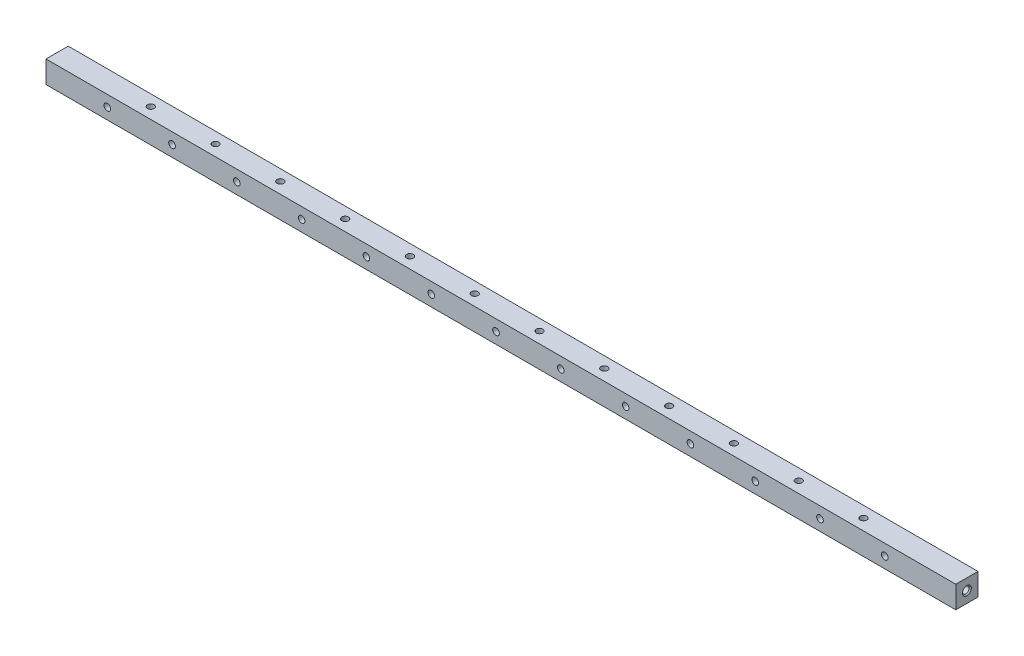
ISO-10303-21;
HEADER;
FILE_DESCRIPTION(('STEP AP214'),'2;1');
FILE_NAME('part.step','',(''),(''),'','','');
FILE_SCHEMA(('AUTOMOTIVE_DESIGN { 1 0 10303 214 1 1 1 1 }'));
ENDSEC;
DATA;
#1=APPLICATION_CONTEXT('core data for automotive mechanical design processes');
#2=APPLICATION_PROTOCOL_DEFINITION('international standard','automotive_design',2000,#1);
#3=PRODUCT_CONTEXT('',#1,'mechanical');
#4=PRODUCT('Part','Part','',(#3));
#5=PRODUCT_RELATED_PRODUCT_CATEGORY('part','',(#4));
#6=PRODUCT_DEFINITION_FORMATION('','',#4);
#7=PRODUCT_DEFINITION_CONTEXT('part definition',#1,'design');
#8=PRODUCT_DEFINITION('design','',#6,#7);
#9=PRODUCT_DEFINITION_SHAPE('','',#8);
#10=(LENGTH_UNIT() NAMED_UNIT(*) SI_UNIT(.MILLI.,.METRE.));
#11=(NAMED_UNIT(*) PLANE_ANGLE_UNIT() SI_UNIT($,.RADIAN.));
#12=(NAMED_UNIT(*) SI_UNIT($,.STERADIAN.) SOLID_ANGLE_UNIT());
#13=UNCERTAINTY_MEASURE_WITH_UNIT(LENGTH_MEASURE(1.E-05),#10,'distance_accuracy_value','');
#14=(GEOMETRIC_REPRESENTATION_CONTEXT(3) GLOBAL_UNCERTAINTY_ASSIGNED_CONTEXT((#13)) GLOBAL_UNIT_ASSIGNED_CONTEXT((#10,
#11,#12)) REPRESENTATION_CONTEXT('',''));
#15=CARTESIAN_POINT('',(0.,0.,0.));
#16=DIRECTION('',(0.,0.,1.));
#17=DIRECTION('',(1.,0.,0.));
#18=AXIS2_PLACEMENT_3D('',#15,#16,#17);
#19=CARTESIAN_POINT('',(520.7,6.35,-6.35));
#20=DIRECTION('',(0.,-1.,0.));
#21=DIRECTION('',(0.,0.,-1.));
#22=AXIS2_PLACEMENT_3D('',#19,#20,#21);
#23=PLANE('',#22);
#24=CARTESIAN_POINT('',(461.518,6.35,0.));
#25=DIRECTION('',(0.,1.,0.));
#26=DIRECTION('',(0.,0.,1.));
#27=AXIS2_PLACEMENT_3D('',#24,#25,#26);
#28=CIRCLE('',#27,1.89865);
#29=CARTESIAN_POINT('',(461.518,6.35,1.89865));
#30=VERTEX_POINT('',#29);
#31=EDGE_CURVE('E783',#30,#30,#28,.T.);
#32=ORIENTED_EDGE('',*,*,#31,.F.);
#33=EDGE_LOOP('',(#32));
#34=FACE_BOUND('',#33,.T.);
#35=CARTESIAN_POINT('',(387.35,6.35,0.));
#36=DIRECTION('',(0.,1.,0.));
#37=DIRECTION('',(0.,0.,1.));
#38=AXIS2_PLACEMENT_3D('',#35,#36,#37);
#39=CIRCLE('',#38,1.89865);
#40=CARTESIAN_POINT('',(387.35,6.35,1.89865));
#41=VERTEX_POINT('',#40);
#42=EDGE_CURVE('E780',#41,#41,#39,.T.);
#43=ORIENTED_EDGE('',*,*,#42,.F.);
#44=EDGE_LOOP('',(#43));
#45=FACE_BOUND('',#44,.T.);
#46=CARTESIAN_POINT('',(350.266,6.35,0.));
#47=DIRECTION('',(0.,1.,0.));
#48=DIRECTION('',(0.,0.,1.));
#49=AXIS2_PLACEMENT_3D('',#46,#47,#48);
#50=CIRCLE('',#49,1.89865);
#51=CARTESIAN_POINT('',(350.266,6.35,1.89865));
#52=VERTEX_POINT('',#51);
#53=EDGE_CURVE('E794',#52,#52,#50,.T.);
#54=ORIENTED_EDGE('',*,*,#53,.F.);
#55=EDGE_LOOP('',(#54));
#56=FACE_BOUND('',#55,.T.);
#57=CARTESIAN_POINT('',(313.182,6.35,0.));
#58=DIRECTION('',(0.,1.,0.));
#59=DIRECTION('',(0.,0.,1.));
#60=AXIS2_PLACEMENT_3D('',#57,#58,#59);
#61=CIRCLE('',#60,1.89865);
#62=CARTESIAN_POINT('',(313.182,6.35,1.89865));
#63=VERTEX_POINT('',#62);
#64=EDGE_CURVE('E802',#63,#63,#61,.T.);
#65=ORIENTED_EDGE('',*,*,#64,.F.);
#66=EDGE_LOOP('',(#65));
#67=FACE_BOUND('',#66,.T.);
#68=CARTESIAN_POINT('',(239.014,6.35,0.));
#69=DIRECTION('',(0.,1.,0.));
#70=DIRECTION('',(0.,0.,1.));
#71=AXIS2_PLACEMENT_3D('',#68,#69,#70);
#72=CIRCLE('',#71,1.89865);
#73=CARTESIAN_POINT('',(239.014,6.35,1.89865));
#74=VERTEX_POINT('',#73);
#75=EDGE_CURVE('E816',#74,#74,#72,.T.);
#76=ORIENTED_EDGE('',*,*,#75,.F.);
#77=EDGE_LOOP('',(#76));
#78=FACE_BOUND('',#77,.T.);
#79=CARTESIAN_POINT('',(201.93,6.35,0.));
#80=DIRECTION('',(0.,1.,0.));
#81=DIRECTION('',(0.,0.,1.));
#82=AXIS2_PLACEMENT_3D('',#79,#80,#81);
#83=CIRCLE('',#82,1.89865);
#84=CARTESIAN_POINT('',(201.93,6.35,1.89865));
#85=VERTEX_POINT('',#84);
#86=EDGE_CURVE('E822',#85,#85,#83,.T.);
#87=ORIENTED_EDGE('',*,*,#86,.F.);
#88=EDGE_LOOP('',(#87));
#89=FACE_BOUND('',#88,.T.);
#90=CARTESIAN_POINT('',(164.846,6.35,0.));
#91=DIRECTION('',(0.,1.,0.));
#92=DIRECTION('',(0.,0.,1.));
#93=AXIS2_PLACEMENT_3D('',#90,#91,#92);
#94=CIRCLE('',#93,1.89865);
#95=CARTESIAN_POINT('',(164.846,6.35,1.89865));
#96=VERTEX_POINT('',#95);
#97=EDGE_CURVE('E830',#96,#96,#94,.T.);
#98=ORIENTED_EDGE('',*,*,#97,.F.);
#99=EDGE_LOOP('',(#98));
#100=FACE_BOUND('',#99,.T.);
#101=CARTESIAN_POINT('',(127.762,6.35,0.));
#102=DIRECTION('',(0.,1.,0.));
#103=DIRECTION('',(0.,0.,1.));
#104=AXIS2_PLACEMENT_3D('',#101,#102,#103);
#105=CIRCLE('',#104,1.89865);
#106=CARTESIAN_POINT('',(127.762,6.35,1.89865));
#107=VERTEX_POINT('',#106);
#108=EDGE_CURVE('E838',#107,#107,#105,.T.);
#109=ORIENTED_EDGE('',*,*,#108,.F.);
#110=EDGE_LOOP('',(#109));
#111=FACE_BOUND('',#110,.T.);
#112=CARTESIAN_POINT('',(90.678,6.35,0.));
#113=DIRECTION('',(0.,1.,0.));
#114=DIRECTION('',(0.,0.,1.));
#115=AXIS2_PLACEMENT_3D('',#112,#113,#114);
#116=CIRCLE('',#115,1.89864999999999);
#117=CARTESIAN_POINT('',(90.678,6.35,1.89864999999999));
#118=VERTEX_POINT('',#117);
#119=EDGE_CURVE('E846',#118,#118,#116,.T.);
#120=ORIENTED_EDGE('',*,*,#119,.F.);
#121=EDGE_LOOP('',(#120));
#122=FACE_BOUND('',#121,.T.);
#123=CARTESIAN_POINT('',(53.594,6.35,0.));
#124=DIRECTION('',(0.,1.,0.));
#125=DIRECTION('',(0.,0.,1.));
#126=AXIS2_PLACEMENT_3D('',#123,#124,#125);
#127=CIRCLE('',#126,1.89864999999999);
#128=CARTESIAN_POINT('',(53.594,6.35,1.89864999999999));
#129=VERTEX_POINT('',#128);
#130=EDGE_CURVE('E137',#129,#129,#127,.T.);
#131=ORIENTED_EDGE('',*,*,#130,.F.);
#132=EDGE_LOOP('',(#131));
#133=FACE_BOUND('',#132,.T.);
#134=DIRECTION('',(0.,0.,1.));
#135=VECTOR('',#134,1.);
#136=CARTESIAN_POINT('',(0.,6.35,-6.35));
#137=LINE('',#136,#135);
#138=CARTESIAN_POINT('',(0.,6.35,-6.35));
#139=VERTEX_POINT('',#138);
#140=CARTESIAN_POINT('',(0.,6.35,6.35));
#141=VERTEX_POINT('',#140);
#142=EDGE_CURVE('E88',#139,#141,#137,.T.);
#143=ORIENTED_EDGE('',*,*,#142,.T.);
#144=DIRECTION('',(-1.,0.,0.));
#145=VECTOR('',#144,1.);
#146=CARTESIAN_POINT('',(520.7,6.35,6.35));
#147=LINE('',#146,#145);
#148=CARTESIAN_POINT('',(520.7,6.35,6.35));
#149=VERTEX_POINT('',#148);
#150=EDGE_CURVE('E163',#149,#141,#147,.T.);
#151=ORIENTED_EDGE('',*,*,#150,.F.);
#152=DIRECTION('',(0.,0.,1.));
#153=VECTOR('',#152,1.);
#154=CARTESIAN_POINT('',(520.7,6.35,-6.35));
#155=LINE('',#154,#153);
#156=CARTESIAN_POINT('',(520.7,6.35,-6.35));
#157=VERTEX_POINT('',#156);
#158=EDGE_CURVE('E60',#157,#149,#155,.T.);
#159=ORIENTED_EDGE('',*,*,#158,.F.);
#160=DIRECTION('',(-1.,0.,0.));
#161=VECTOR('',#160,1.);
#162=CARTESIAN_POINT('',(520.7,6.35,-6.35));
#163=LINE('',#162,#161);
#164=EDGE_CURVE('E176',#157,#139,#163,.T.);
#165=ORIENTED_EDGE('',*,*,#164,.T.);
#166=EDGE_LOOP('',(#143,#151,#159,#165));
#167=FACE_BOUND('',#166,.T.);
#168=CARTESIAN_POINT('',(276.098,6.35,0.));
#169=DIRECTION('',(0.,1.,0.));
#170=DIRECTION('',(0.,0.,1.));
#171=AXIS2_PLACEMENT_3D('',#168,#169,#170);
#172=CIRCLE('',#171,1.89865);
#173=CARTESIAN_POINT('',(276.098,6.35,1.89865));
#174=VERTEX_POINT('',#173);
#175=EDGE_CURVE('E769',#174,#174,#172,.T.);
#176=ORIENTED_EDGE('',*,*,#175,.F.);
#177=EDGE_LOOP('',(#176));
#178=FACE_BOUND('',#177,.T.);
#179=CARTESIAN_POINT('',(424.434,6.35,0.));
#180=DIRECTION('',(0.,1.,0.));
#181=DIRECTION('',(0.,0.,1.));
#182=AXIS2_PLACEMENT_3D('',#179,#180,#181);
#183=CIRCLE('',#182,1.89865);
#184=CARTESIAN_POINT('',(424.434,6.35,1.89865));
#185=VERTEX_POINT('',#184);
#186=EDGE_CURVE('E772',#185,#185,#183,.T.);
#187=ORIENTED_EDGE('',*,*,#186,.F.);
#188=EDGE_LOOP('',(#187));
#189=FACE_BOUND('',#188,.T.);
#190=ADVANCED_FACE('F42',(#34,#45,#56,#67,#78,#89,#100,#111,#122,#133,#167,#178,#189),#23,.F.);
#191=CARTESIAN_POINT('',(480.06,0.,6.35));
#192=DIRECTION('',(0.,0.,1.));
#193=DIRECTION('',(1.,0.,0.));
#194=AXIS2_PLACEMENT_3D('',#191,#192,#193);
#195=CYLINDRICAL_SURFACE('',#194,1.89864999999999);
#196=CARTESIAN_POINT('',(480.06,0.,-6.35));
#197=DIRECTION('',(0.,0.,1.));
#198=DIRECTION('',(1.,0.,0.));
#199=AXIS2_PLACEMENT_3D('',#196,#197,#198);
#200=CIRCLE('',#199,1.89864999999999);
#201=CARTESIAN_POINT('',(481.95865,0.,-6.35));
#202=VERTEX_POINT('',#201);
#203=EDGE_CURVE('E52',#202,#202,#200,.T.);
#204=ORIENTED_EDGE('',*,*,#203,.F.);
#205=EDGE_LOOP('',(#204));
#206=FACE_BOUND('',#205,.T.);
#207=CARTESIAN_POINT('',(480.06,0.,6.35));
#208=DIRECTION('',(0.,0.,1.));
#209=DIRECTION('',(1.,0.,0.));
#210=AXIS2_PLACEMENT_3D('',#207,#208,#209);
#211=CIRCLE('',#210,1.89864999999999);
#212=CARTESIAN_POINT('',(481.95865,0.,6.35));
#213=VERTEX_POINT('',#212);
#214=EDGE_CURVE('E11',#213,#213,#211,.T.);
#215=ORIENTED_EDGE('',*,*,#214,.T.);
#216=EDGE_LOOP('',(#215));
#217=FACE_BOUND('',#216,.T.);
#218=ADVANCED_FACE('F44',(#206,#217),#195,.F.);
#219=CARTESIAN_POINT('',(442.976,0.,6.35));
#220=DIRECTION('',(0.,0.,1.));
#221=DIRECTION('',(1.,0.,0.));
#222=AXIS2_PLACEMENT_3D('',#219,#220,#221);
#223=CYLINDRICAL_SURFACE('',#222,1.89864999999999);
#224=CARTESIAN_POINT('',(442.976,0.,-6.35));
#225=DIRECTION('',(0.,0.,1.));
#226=DIRECTION('',(1.,0.,0.));
#227=AXIS2_PLACEMENT_3D('',#224,#225,#226);
#228=CIRCLE('',#227,1.89864999999999);
#229=CARTESIAN_POINT('',(444.87465,0.,-6.35));
#230=VERTEX_POINT('',#229);
#231=EDGE_CURVE('E255',#230,#230,#228,.T.);
#232=ORIENTED_EDGE('',*,*,#231,.F.);
#233=EDGE_LOOP('',(#232));
#234=FACE_BOUND('',#233,.T.);
#235=CARTESIAN_POINT('',(442.976,0.,6.35));
#236=DIRECTION('',(0.,0.,1.));
#237=DIRECTION('',(1.,0.,0.));
#238=AXIS2_PLACEMENT_3D('',#235,#236,#237);
#239=CIRCLE('',#238,1.89864999999999);
#240=CARTESIAN_POINT('',(444.87465,0.,6.35));
#241=VERTEX_POINT('',#240);
#242=EDGE_CURVE('E259',#241,#241,#239,.T.);
#243=ORIENTED_EDGE('',*,*,#242,.T.);
#244=EDGE_LOOP('',(#243));
#245=FACE_BOUND('',#244,.T.);
#246=ADVANCED_FACE('F271',(#234,#245),#223,.F.);
#247=CARTESIAN_POINT('',(405.892,0.,6.35));
#248=DIRECTION('',(0.,0.,1.));
#249=DIRECTION('',(1.,0.,0.));
#250=AXIS2_PLACEMENT_3D('',#247,#248,#249);
#251=CYLINDRICAL_SURFACE('',#250,1.89864999999999);
#252=CARTESIAN_POINT('',(405.892,0.,-6.35));
#253=DIRECTION('',(0.,0.,1.));
#254=DIRECTION('',(1.,0.,0.));
#255=AXIS2_PLACEMENT_3D('',#252,#253,#254);
#256=CIRCLE('',#255,1.89864999999999);
#257=CARTESIAN_POINT('',(407.79065,0.,-6.35));
#258=VERTEX_POINT('',#257);
#259=EDGE_CURVE('E247',#258,#258,#256,.T.);
#260=ORIENTED_EDGE('',*,*,#259,.F.);
#261=EDGE_LOOP('',(#260));
#262=FACE_BOUND('',#261,.T.);
#263=CARTESIAN_POINT('',(405.892,0.,6.35));
#264=DIRECTION('',(0.,0.,1.));
#265=DIRECTION('',(1.,0.,0.));
#266=AXIS2_PLACEMENT_3D('',#263,#264,#265);
#267=CIRCLE('',#266,1.89864999999999);
#268=CARTESIAN_POINT('',(407.79065,0.,6.35));
#269=VERTEX_POINT('',#268);
#270=EDGE_CURVE('E251',#269,#269,#267,.T.);
#271=ORIENTED_EDGE('',*,*,#270,.T.);
#272=EDGE_LOOP('',(#271));
#273=FACE_BOUND('',#272,.T.);
#274=ADVANCED_FACE('F337',(#262,#273),#251,.F.);
#275=CARTESIAN_POINT('',(368.808,0.,6.35));
#276=DIRECTION('',(0.,0.,1.));
#277=DIRECTION('',(1.,0.,0.));
#278=AXIS2_PLACEMENT_3D('',#275,#276,#277);
#279=CYLINDRICAL_SURFACE('',#278,1.89864999999999);
#280=CARTESIAN_POINT('',(368.808,0.,-6.35));
#281=DIRECTION('',(0.,0.,1.));
#282=DIRECTION('',(1.,0.,0.));
#283=AXIS2_PLACEMENT_3D('',#280,#281,#282);
#284=CIRCLE('',#283,1.89864999999999);
#285=CARTESIAN_POINT('',(370.70665,0.,-6.35));
#286=VERTEX_POINT('',#285);
#287=EDGE_CURVE('E239',#286,#286,#284,.T.);
#288=ORIENTED_EDGE('',*,*,#287,.F.);
#289=EDGE_LOOP('',(#288));
#290=FACE_BOUND('',#289,.T.);
#291=CARTESIAN_POINT('',(368.808,0.,6.35));
#292=DIRECTION('',(0.,0.,1.));
#293=DIRECTION('',(1.,0.,0.));
#294=AXIS2_PLACEMENT_3D('',#291,#292,#293);
#295=CIRCLE('',#294,1.89864999999999);
#296=CARTESIAN_POINT('',(370.70665,0.,6.35));
#297=VERTEX_POINT('',#296);
#298=EDGE_CURVE('E243',#297,#297,#295,.T.);
#299=ORIENTED_EDGE('',*,*,#298,.T.);
#300=EDGE_LOOP('',(#299));
#301=FACE_BOUND('',#300,.T.);
#302=ADVANCED_FACE('F343',(#290,#301),#279,.F.);
#303=CARTESIAN_POINT('',(331.724,0.,6.35));
#304=DIRECTION('',(0.,0.,1.));
#305=DIRECTION('',(1.,0.,0.));
#306=AXIS2_PLACEMENT_3D('',#303,#304,#305);
#307=CYLINDRICAL_SURFACE('',#306,1.89864999999999);
#308=CARTESIAN_POINT('',(331.724,0.,-6.35));
#309=DIRECTION('',(0.,0.,1.));
#310=DIRECTION('',(1.,0.,0.));
#311=AXIS2_PLACEMENT_3D('',#308,#309,#310);
#312=CIRCLE('',#311,1.89864999999999);
#313=CARTESIAN_POINT('',(333.62265,0.,-6.35));
#314=VERTEX_POINT('',#313);
#315=EDGE_CURVE('E231',#314,#314,#312,.T.);
#316=ORIENTED_EDGE('',*,*,#315,.F.);
#317=EDGE_LOOP('',(#316));
#318=FACE_BOUND('',#317,.T.);
#319=CARTESIAN_POINT('',(331.724,0.,6.35));
#320=DIRECTION('',(0.,0.,1.));
#321=DIRECTION('',(1.,0.,0.));
#322=AXIS2_PLACEMENT_3D('',#319,#320,#321);
#323=CIRCLE('',#322,1.89864999999999);
#324=CARTESIAN_POINT('',(333.62265,0.,6.35));
#325=VERTEX_POINT('',#324);
#326=EDGE_CURVE('E235',#325,#325,#323,.T.);
#327=ORIENTED_EDGE('',*,*,#326,.T.);
#328=EDGE_LOOP('',(#327));
#329=FACE_BOUND('',#328,.T.);
#330=ADVANCED_FACE('F349',(#318,#329),#307,.F.);
#331=CARTESIAN_POINT('',(294.64,0.,6.35));
#332=DIRECTION('',(0.,0.,1.));
#333=DIRECTION('',(1.,0.,0.));
#334=AXIS2_PLACEMENT_3D('',#331,#332,#333);
#335=CYLINDRICAL_SURFACE('',#334,1.89864999999999);
#336=CARTESIAN_POINT('',(294.64,0.,-6.35));
#337=DIRECTION('',(0.,0.,1.));
#338=DIRECTION('',(1.,0.,0.));
#339=AXIS2_PLACEMENT_3D('',#336,#337,#338);
#340=CIRCLE('',#339,1.89864999999999);
#341=CARTESIAN_POINT('',(296.53865,0.,-6.35));
#342=VERTEX_POINT('',#341);
#343=EDGE_CURVE('E223',#342,#342,#340,.T.);
#344=ORIENTED_EDGE('',*,*,#343,.F.);
#345=EDGE_LOOP('',(#344));
#346=FACE_BOUND('',#345,.T.);
#347=CARTESIAN_POINT('',(294.64,0.,6.35));
#348=DIRECTION('',(0.,0.,1.));
#349=DIRECTION('',(1.,0.,0.));
#350=AXIS2_PLACEMENT_3D('',#347,#348,#349);
#351=CIRCLE('',#350,1.89864999999999);
#352=CARTESIAN_POINT('',(296.53865,0.,6.35));
#353=VERTEX_POINT('',#352);
#354=EDGE_CURVE('E227',#353,#353,#351,.T.);
#355=ORIENTED_EDGE('',*,*,#354,.T.);
#356=EDGE_LOOP('',(#355));
#357=FACE_BOUND('',#356,.T.);
#358=ADVANCED_FACE('F353',(#346,#357),#335,.F.);
#359=CARTESIAN_POINT('',(257.556,0.,6.35));
#360=DIRECTION('',(0.,0.,1.));
#361=DIRECTION('',(1.,0.,0.));
#362=AXIS2_PLACEMENT_3D('',#359,#360,#361);
#363=CYLINDRICAL_SURFACE('',#362,1.89864999999999);
#364=CARTESIAN_POINT('',(257.556,0.,-6.35));
#365=DIRECTION('',(0.,0.,1.));
#366=DIRECTION('',(1.,0.,0.));
#367=AXIS2_PLACEMENT_3D('',#364,#365,#366);
#368=CIRCLE('',#367,1.89864999999999);
#369=CARTESIAN_POINT('',(259.45465,0.,-6.35));
#370=VERTEX_POINT('',#369);
#371=EDGE_CURVE('E216',#370,#370,#368,.T.);
#372=ORIENTED_EDGE('',*,*,#371,.F.);
#373=EDGE_LOOP('',(#372));
#374=FACE_BOUND('',#373,.T.);
#375=CARTESIAN_POINT('',(257.556,0.,6.35));
#376=DIRECTION('',(0.,0.,1.));
#377=DIRECTION('',(1.,0.,0.));
#378=AXIS2_PLACEMENT_3D('',#375,#376,#377);
#379=CIRCLE('',#378,1.89864999999999);
#380=CARTESIAN_POINT('',(259.45465,0.,6.35));
#381=VERTEX_POINT('',#380);
#382=EDGE_CURVE('E219',#381,#381,#379,.T.);
#383=ORIENTED_EDGE('',*,*,#382,.T.);
#384=EDGE_LOOP('',(#383));
#385=FACE_BOUND('',#384,.T.);
#386=ADVANCED_FACE('F357',(#374,#385),#363,.F.);
#387=CARTESIAN_POINT('',(220.472,0.,6.35));
#388=DIRECTION('',(0.,0.,1.));
#389=DIRECTION('',(1.,0.,0.));
#390=AXIS2_PLACEMENT_3D('',#387,#388,#389);
#391=CYLINDRICAL_SURFACE('',#390,1.89864999999999);
#392=CARTESIAN_POINT('',(220.472,0.,-6.35));
#393=DIRECTION('',(0.,0.,1.));
#394=DIRECTION('',(1.,0.,0.));
#395=AXIS2_PLACEMENT_3D('',#392,#393,#394);
#396=CIRCLE('',#395,1.89864999999999);
#397=CARTESIAN_POINT('',(222.37065,0.,-6.35));
#398=VERTEX_POINT('',#397);
#399=EDGE_CURVE('E209',#398,#398,#396,.T.);
#400=ORIENTED_EDGE('',*,*,#399,.F.);
#401=EDGE_LOOP('',(#400));
#402=FACE_BOUND('',#401,.T.);
#403=CARTESIAN_POINT('',(220.472,0.,6.35));
#404=DIRECTION('',(0.,0.,1.));
#405=DIRECTION('',(1.,0.,0.));
#406=AXIS2_PLACEMENT_3D('',#403,#404,#405);
#407=CIRCLE('',#406,1.89864999999999);
#408=CARTESIAN_POINT('',(222.37065,0.,6.35));
#409=VERTEX_POINT('',#408);
#410=EDGE_CURVE('E212',#409,#409,#407,.T.);
#411=ORIENTED_EDGE('',*,*,#410,.T.);
#412=EDGE_LOOP('',(#411));
#413=FACE_BOUND('',#412,.T.);
#414=ADVANCED_FACE('F361',(#402,#413),#391,.F.);
#415=CARTESIAN_POINT('',(183.388,0.,6.35));
#416=DIRECTION('',(0.,0.,1.));
#417=DIRECTION('',(1.,0.,0.));
#418=AXIS2_PLACEMENT_3D('',#415,#416,#417);
#419=CYLINDRICAL_SURFACE('',#418,1.89864999999999);
#420=CARTESIAN_POINT('',(183.388,0.,-6.35));
#421=DIRECTION('',(0.,0.,1.));
#422=DIRECTION('',(1.,0.,0.));
#423=AXIS2_PLACEMENT_3D('',#420,#421,#422);
#424=CIRCLE('',#423,1.89864999999999);
#425=CARTESIAN_POINT('',(185.28665,0.,-6.35));
#426=VERTEX_POINT('',#425);
#427=EDGE_CURVE('E201',#426,#426,#424,.T.);
#428=ORIENTED_EDGE('',*,*,#427,.F.);
#429=EDGE_LOOP('',(#428));
#430=FACE_BOUND('',#429,.T.);
#431=CARTESIAN_POINT('',(183.388,0.,6.35));
#432=DIRECTION('',(0.,0.,1.));
#433=DIRECTION('',(1.,0.,0.));
#434=AXIS2_PLACEMENT_3D('',#431,#432,#433);
#435=CIRCLE('',#434,1.89864999999999);
#436=CARTESIAN_POINT('',(185.28665,0.,6.35));
#437=VERTEX_POINT('',#436);
#438=EDGE_CURVE('E205',#437,#437,#435,.T.);
#439=ORIENTED_EDGE('',*,*,#438,.T.);
#440=EDGE_LOOP('',(#439));
#441=FACE_BOUND('',#440,.T.);
#442=ADVANCED_FACE('F365',(#430,#441),#419,.F.);
#443=CARTESIAN_POINT('',(146.304,0.,6.35));
#444=DIRECTION('',(0.,0.,1.));
#445=DIRECTION('',(1.,0.,0.));
#446=AXIS2_PLACEMENT_3D('',#443,#444,#445);
#447=CYLINDRICAL_SURFACE('',#446,1.89864999999999);
#448=CARTESIAN_POINT('',(146.304,0.,-6.35));
#449=DIRECTION('',(0.,0.,1.));
#450=DIRECTION('',(1.,0.,0.));
#451=AXIS2_PLACEMENT_3D('',#448,#449,#450);
#452=CIRCLE('',#451,1.89864999999999);
#453=CARTESIAN_POINT('',(148.20265,0.,-6.35));
#454=VERTEX_POINT('',#453);
#455=EDGE_CURVE('E193',#454,#454,#452,.T.);
#456=ORIENTED_EDGE('',*,*,#455,.F.);
#457=EDGE_LOOP('',(#456));
#458=FACE_BOUND('',#457,.T.);
#459=CARTESIAN_POINT('',(146.304,0.,6.35));
#460=DIRECTION('',(0.,0.,1.));
#461=DIRECTION('',(1.,0.,0.));
#462=AXIS2_PLACEMENT_3D('',#459,#460,#461);
#463=CIRCLE('',#462,1.89864999999999);
#464=CARTESIAN_POINT('',(148.20265,0.,6.35));
#465=VERTEX_POINT('',#464);
#466=EDGE_CURVE('E197',#465,#465,#463,.T.);
#467=ORIENTED_EDGE('',*,*,#466,.T.);
#468=EDGE_LOOP('',(#467));
#469=FACE_BOUND('',#468,.T.);
#470=ADVANCED_FACE('F286',(#458,#469),#447,.F.);
#471=CARTESIAN_POINT('',(109.22,0.,6.35));
#472=DIRECTION('',(0.,0.,1.));
#473=DIRECTION('',(1.,0.,0.));
#474=AXIS2_PLACEMENT_3D('',#471,#472,#473);
#475=CYLINDRICAL_SURFACE('',#474,1.89864999999999);
#476=CARTESIAN_POINT('',(109.22,0.,-6.35));
#477=DIRECTION('',(0.,0.,1.));
#478=DIRECTION('',(1.,0.,0.));
#479=AXIS2_PLACEMENT_3D('',#476,#477,#478);
#480=CIRCLE('',#479,1.89864999999999);
#481=CARTESIAN_POINT('',(111.11865,0.,-6.35));
#482=VERTEX_POINT('',#481);
#483=EDGE_CURVE('E185',#482,#482,#480,.T.);
#484=ORIENTED_EDGE('',*,*,#483,.F.);
#485=EDGE_LOOP('',(#484));
#486=FACE_BOUND('',#485,.T.);
#487=CARTESIAN_POINT('',(109.22,0.,6.35));
#488=DIRECTION('',(0.,0.,1.));
#489=DIRECTION('',(1.,0.,0.));
#490=AXIS2_PLACEMENT_3D('',#487,#488,#489);
#491=CIRCLE('',#490,1.89864999999999);
#492=CARTESIAN_POINT('',(111.11865,0.,6.35));
#493=VERTEX_POINT('',#492);
#494=EDGE_CURVE('E189',#493,#493,#491,.T.);
#495=ORIENTED_EDGE('',*,*,#494,.T.);
#496=EDGE_LOOP('',(#495));
#497=FACE_BOUND('',#496,.T.);
#498=ADVANCED_FACE('F277',(#486,#497),#475,.F.);
#499=CARTESIAN_POINT('',(520.7,-6.35,6.35));
#500=DIRECTION('',(0.,0.,-1.));
#501=DIRECTION('',(-1.,0.,0.));
#502=AXIS2_PLACEMENT_3D('',#499,#500,#501);
#503=PLANE('',#502);
#504=CARTESIAN_POINT('',(72.136,0.,6.35));
#505=DIRECTION('',(0.,0.,1.));
#506=DIRECTION('',(1.,0.,0.));
#507=AXIS2_PLACEMENT_3D('',#504,#505,#506);
#508=CIRCLE('',#507,1.89864999999999);
#509=CARTESIAN_POINT('',(74.03465,0.,6.35));
#510=VERTEX_POINT('',#509);
#511=EDGE_CURVE('E856',#510,#510,#508,.T.);
#512=ORIENTED_EDGE('',*,*,#511,.F.);
#513=EDGE_LOOP('',(#512));
#514=FACE_BOUND('',#513,.T.);
#515=CARTESIAN_POINT('',(35.052,0.,6.35));
#516=DIRECTION('',(0.,0.,1.));
#517=DIRECTION('',(1.,0.,0.));
#518=AXIS2_PLACEMENT_3D('',#515,#516,#517);
#519=CIRCLE('',#518,1.89864999999999);
#520=CARTESIAN_POINT('',(36.95065,0.,6.35));
#521=VERTEX_POINT('',#520);
#522=EDGE_CURVE('E145',#521,#521,#519,.T.);
#523=ORIENTED_EDGE('',*,*,#522,.F.);
#524=EDGE_LOOP('',(#523));
#525=FACE_BOUND('',#524,.T.);
#526=DIRECTION('',(0.,-1.,0.));
#527=VECTOR('',#526,1.);
#528=CARTESIAN_POINT('',(0.,-6.35,6.35));
#529=LINE('',#528,#527);
#530=CARTESIAN_POINT('',(0.,-6.35,6.35));
#531=VERTEX_POINT('',#530);
#532=EDGE_CURVE('E153',#141,#531,#529,.T.);
#533=ORIENTED_EDGE('',*,*,#532,.T.);
#534=DIRECTION('',(-1.,0.,0.));
#535=VECTOR('',#534,1.);
#536=CARTESIAN_POINT('',(520.7,-6.35,6.35));
#537=LINE('',#536,#535);
#538=CARTESIAN_POINT('',(520.7,-6.35,6.35));
#539=VERTEX_POINT('',#538);
#540=EDGE_CURVE('E182',#539,#531,#537,.T.);
#541=ORIENTED_EDGE('',*,*,#540,.F.);
#542=DIRECTION('',(0.,-1.,0.));
#543=VECTOR('',#542,1.);
#544=CARTESIAN_POINT('',(520.7,-6.35,6.35));
#545=LINE('',#544,#543);
#546=EDGE_CURVE('E154',#149,#539,#545,.T.);
#547=ORIENTED_EDGE('',*,*,#546,.F.);
#548=ORIENTED_EDGE('',*,*,#150,.T.);
#549=EDGE_LOOP('',(#533,#541,#547,#548));
#550=FACE_BOUND('',#549,.T.);
#551=ORIENTED_EDGE('',*,*,#494,.F.);
#552=EDGE_LOOP('',(#551));
#553=FACE_BOUND('',#552,.T.);
#554=ORIENTED_EDGE('',*,*,#466,.F.);
#555=EDGE_LOOP('',(#554));
#556=FACE_BOUND('',#555,.T.);
#557=ORIENTED_EDGE('',*,*,#438,.F.);
#558=EDGE_LOOP('',(#557));
#559=FACE_BOUND('',#558,.T.);
#560=ORIENTED_EDGE('',*,*,#410,.F.);
#561=EDGE_LOOP('',(#560));
#562=FACE_BOUND('',#561,.T.);
#563=ORIENTED_EDGE('',*,*,#382,.F.);
#564=EDGE_LOOP('',(#563));
#565=FACE_BOUND('',#564,.T.);
#566=ORIENTED_EDGE('',*,*,#354,.F.);
#567=EDGE_LOOP('',(#566));
#568=FACE_BOUND('',#567,.T.);
#569=ORIENTED_EDGE('',*,*,#326,.F.);
#570=EDGE_LOOP('',(#569));
#571=FACE_BOUND('',#570,.T.);
#572=ORIENTED_EDGE('',*,*,#298,.F.);
#573=EDGE_LOOP('',(#572));
#574=FACE_BOUND('',#573,.T.);
#575=ORIENTED_EDGE('',*,*,#270,.F.);
#576=EDGE_LOOP('',(#575));
#577=FACE_BOUND('',#576,.T.);
#578=ORIENTED_EDGE('',*,*,#242,.F.);
#579=EDGE_LOOP('',(#578));
#580=FACE_BOUND('',#579,.T.);
#581=ORIENTED_EDGE('',*,*,#214,.F.);
#582=EDGE_LOOP('',(#581));
#583=FACE_BOUND('',#582,.T.);
#584=ADVANCED_FACE('F274',(#514,#525,#550,#553,#556,#559,#562,#565,#568,#571,#574,#577,#580,
#583),#503,.F.);
#585=CARTESIAN_POINT('',(520.7,-6.35,-6.35));
#586=DIRECTION('',(0.,1.,0.));
#587=DIRECTION('',(0.,0.,1.));
#588=AXIS2_PLACEMENT_3D('',#585,#586,#587);
#589=PLANE('',#588);
#590=CARTESIAN_POINT('',(461.518,-6.35,0.));
#591=DIRECTION('',(0.,1.,0.));
#592=DIRECTION('',(0.,0.,1.));
#593=AXIS2_PLACEMENT_3D('',#590,#591,#592);
#594=CIRCLE('',#593,1.89865);
#595=CARTESIAN_POINT('',(461.518,-6.35,1.89865));
#596=VERTEX_POINT('',#595);
#597=EDGE_CURVE('E776',#596,#596,#594,.T.);
#598=ORIENTED_EDGE('',*,*,#597,.T.);
#599=EDGE_LOOP('',(#598));
#600=FACE_BOUND('',#599,.T.);
#601=CARTESIAN_POINT('',(424.434,-6.35,0.));
#602=DIRECTION('',(0.,1.,0.));
#603=DIRECTION('',(0.,0.,1.));
#604=AXIS2_PLACEMENT_3D('',#601,#602,#603);
#605=CIRCLE('',#604,1.89865);
#606=CARTESIAN_POINT('',(424.434,-6.35,1.89865));
#607=VERTEX_POINT('',#606);
#608=EDGE_CURVE('E775',#607,#607,#605,.T.);
#609=ORIENTED_EDGE('',*,*,#608,.T.);
#610=EDGE_LOOP('',(#609));
#611=FACE_BOUND('',#610,.T.);
#612=CARTESIAN_POINT('',(387.35,-6.35,0.));
#613=DIRECTION('',(0.,1.,0.));
#614=DIRECTION('',(0.,0.,1.));
#615=AXIS2_PLACEMENT_3D('',#612,#613,#614);
#616=CIRCLE('',#615,1.89865);
#617=CARTESIAN_POINT('',(387.35,-6.35,1.89865));
#618=VERTEX_POINT('',#617);
#619=EDGE_CURVE('E790',#618,#618,#616,.T.);
#620=ORIENTED_EDGE('',*,*,#619,.T.);
#621=EDGE_LOOP('',(#620));
#622=FACE_BOUND('',#621,.T.);
#623=CARTESIAN_POINT('',(350.266,-6.35,0.));
#624=DIRECTION('',(0.,1.,0.));
#625=DIRECTION('',(0.,0.,1.));
#626=AXIS2_PLACEMENT_3D('',#623,#624,#625);
#627=CIRCLE('',#626,1.89865);
#628=CARTESIAN_POINT('',(350.266,-6.35,1.89865));
#629=VERTEX_POINT('',#628);
#630=EDGE_CURVE('E798',#629,#629,#627,.T.);
#631=ORIENTED_EDGE('',*,*,#630,.T.);
#632=EDGE_LOOP('',(#631));
#633=FACE_BOUND('',#632,.T.);
#634=CARTESIAN_POINT('',(313.182,-6.35,0.));
#635=DIRECTION('',(0.,1.,0.));
#636=DIRECTION('',(0.,0.,1.));
#637=AXIS2_PLACEMENT_3D('',#634,#635,#636);
#638=CIRCLE('',#637,1.89865);
#639=CARTESIAN_POINT('',(313.182,-6.35,1.89865));
#640=VERTEX_POINT('',#639);
#641=EDGE_CURVE('E806',#640,#640,#638,.T.);
#642=ORIENTED_EDGE('',*,*,#641,.T.);
#643=EDGE_LOOP('',(#642));
#644=FACE_BOUND('',#643,.T.);
#645=CARTESIAN_POINT('',(276.098,-6.35,0.));
#646=DIRECTION('',(0.,1.,0.));
#647=DIRECTION('',(0.,0.,1.));
#648=AXIS2_PLACEMENT_3D('',#645,#646,#647);
#649=CIRCLE('',#648,1.89865);
#650=CARTESIAN_POINT('',(276.098,-6.35,1.89865));
#651=VERTEX_POINT('',#650);
#652=EDGE_CURVE('E812',#651,#651,#649,.T.);
#653=ORIENTED_EDGE('',*,*,#652,.T.);
#654=EDGE_LOOP('',(#653));
#655=FACE_BOUND('',#654,.T.);
#656=CARTESIAN_POINT('',(239.014,-6.35,0.));
#657=DIRECTION('',(0.,1.,0.));
#658=DIRECTION('',(0.,0.,1.));
#659=AXIS2_PLACEMENT_3D('',#656,#657,#658);
#660=CIRCLE('',#659,1.89865);
#661=CARTESIAN_POINT('',(239.014,-6.35,1.89865));
#662=VERTEX_POINT('',#661);
#663=EDGE_CURVE('E819',#662,#662,#660,.T.);
#664=ORIENTED_EDGE('',*,*,#663,.T.);
#665=EDGE_LOOP('',(#664));
#666=FACE_BOUND('',#665,.T.);
#667=CARTESIAN_POINT('',(201.93,-6.35,0.));
#668=DIRECTION('',(0.,1.,0.));
#669=DIRECTION('',(0.,0.,1.));
#670=AXIS2_PLACEMENT_3D('',#667,#668,#669);
#671=CIRCLE('',#670,1.89865);
#672=CARTESIAN_POINT('',(201.93,-6.35,1.89865));
#673=VERTEX_POINT('',#672);
#674=EDGE_CURVE('E826',#673,#673,#671,.T.);
#675=ORIENTED_EDGE('',*,*,#674,.T.);
#676=EDGE_LOOP('',(#675));
#677=FACE_BOUND('',#676,.T.);
#678=CARTESIAN_POINT('',(164.846,-6.35,0.));
#679=DIRECTION('',(0.,1.,0.));
#680=DIRECTION('',(0.,0.,1.));
#681=AXIS2_PLACEMENT_3D('',#678,#679,#680);
#682=CIRCLE('',#681,1.89865);
#683=CARTESIAN_POINT('',(164.846,-6.35,1.89865));
#684=VERTEX_POINT('',#683);
#685=EDGE_CURVE('E834',#684,#684,#682,.T.);
#686=ORIENTED_EDGE('',*,*,#685,.T.);
#687=EDGE_LOOP('',(#686));
#688=FACE_BOUND('',#687,.T.);
#689=CARTESIAN_POINT('',(127.762,-6.35,0.));
#690=DIRECTION('',(0.,1.,0.));
#691=DIRECTION('',(0.,0.,1.));
#692=AXIS2_PLACEMENT_3D('',#689,#690,#691);
#693=CIRCLE('',#692,1.89865);
#694=CARTESIAN_POINT('',(127.762,-6.35,1.89865));
#695=VERTEX_POINT('',#694);
#696=EDGE_CURVE('E842',#695,#695,#693,.T.);
#697=ORIENTED_EDGE('',*,*,#696,.T.);
#698=EDGE_LOOP('',(#697));
#699=FACE_BOUND('',#698,.T.);
#700=CARTESIAN_POINT('',(90.678,-6.35,0.));
#701=DIRECTION('',(0.,1.,0.));
#702=DIRECTION('',(0.,0.,1.));
#703=AXIS2_PLACEMENT_3D('',#700,#701,#702);
#704=CIRCLE('',#703,1.89865);
#705=CARTESIAN_POINT('',(90.678,-6.35,1.89865));
#706=VERTEX_POINT('',#705);
#707=EDGE_CURVE('E850',#706,#706,#704,.T.);
#708=ORIENTED_EDGE('',*,*,#707,.T.);
#709=EDGE_LOOP('',(#708));
#710=FACE_BOUND('',#709,.T.);
#711=CARTESIAN_POINT('',(53.594,-6.35,0.));
#712=DIRECTION('',(0.,1.,0.));
#713=DIRECTION('',(0.,0.,1.));
#714=AXIS2_PLACEMENT_3D('',#711,#712,#713);
#715=CIRCLE('',#714,1.89864999999999);
#716=CARTESIAN_POINT('',(53.594,-6.35,1.89864999999999));
#717=VERTEX_POINT('',#716);
#718=EDGE_CURVE('E141',#717,#717,#715,.T.);
#719=ORIENTED_EDGE('',*,*,#718,.T.);
#720=EDGE_LOOP('',(#719));
#721=FACE_BOUND('',#720,.T.);
#722=DIRECTION('',(0.,0.,-1.));
#723=VECTOR('',#722,1.);
#724=CARTESIAN_POINT('',(0.,-6.35,-6.35));
#725=LINE('',#724,#723);
#726=CARTESIAN_POINT('',(0.,-6.35,-6.35));
#727=VERTEX_POINT('',#726);
#728=EDGE_CURVE('E167',#531,#727,#725,.T.);
#729=ORIENTED_EDGE('',*,*,#728,.T.);
#730=DIRECTION('',(-1.,0.,0.));
#731=VECTOR('',#730,1.);
#732=CARTESIAN_POINT('',(520.7,-6.35,-6.35));
#733=LINE('',#732,#731);
#734=CARTESIAN_POINT('',(520.7,-6.35,-6.35));
#735=VERTEX_POINT('',#734);
#736=EDGE_CURVE('E179',#735,#727,#733,.T.);
#737=ORIENTED_EDGE('',*,*,#736,.F.);
#738=DIRECTION('',(0.,0.,-1.));
#739=VECTOR('',#738,1.);
#740=CARTESIAN_POINT('',(520.7,-6.35,-6.35));
#741=LINE('',#740,#739);
#742=EDGE_CURVE('E98',#539,#735,#741,.T.);
#743=ORIENTED_EDGE('',*,*,#742,.F.);
#744=ORIENTED_EDGE('',*,*,#540,.T.);
#745=EDGE_LOOP('',(#729,#737,#743,#744));
#746=FACE_BOUND('',#745,.T.);
#747=ADVANCED_FACE('F276',(#600,#611,#622,#633,#644,#655,#666,#677,#688,#699,#710,#721,#746),
#589,.F.);
#748=CARTESIAN_POINT('',(520.7,-6.35,-6.35));
#749=DIRECTION('',(0.,0.,1.));
#750=DIRECTION('',(1.,0.,0.));
#751=AXIS2_PLACEMENT_3D('',#748,#749,#750);
#752=PLANE('',#751);
#753=CARTESIAN_POINT('',(72.136,0.,-6.35));
#754=DIRECTION('',(0.,0.,1.));
#755=DIRECTION('',(1.,0.,0.));
#756=AXIS2_PLACEMENT_3D('',#753,#754,#755);
#757=CIRCLE('',#756,1.89864999999999);
#758=CARTESIAN_POINT('',(74.03465,0.,-6.35));
#759=VERTEX_POINT('',#758);
#760=EDGE_CURVE('E312',#759,#759,#757,.T.);
#761=ORIENTED_EDGE('',*,*,#760,.T.);
#762=EDGE_LOOP('',(#761));
#763=FACE_BOUND('',#762,.T.);
#764=CARTESIAN_POINT('',(35.052,0.,-6.35));
#765=DIRECTION('',(0.,0.,1.));
#766=DIRECTION('',(1.,0.,0.));
#767=AXIS2_PLACEMENT_3D('',#764,#765,#766);
#768=CIRCLE('',#767,1.89864999999999);
#769=CARTESIAN_POINT('',(36.95065,0.,-6.35));
#770=VERTEX_POINT('',#769);
#771=EDGE_CURVE('E149',#770,#770,#768,.T.);
#772=ORIENTED_EDGE('',*,*,#771,.T.);
#773=EDGE_LOOP('',(#772));
#774=FACE_BOUND('',#773,.T.);
#775=DIRECTION('',(0.,1.,0.));
#776=VECTOR('',#775,1.);
#777=CARTESIAN_POINT('',(0.,-6.35,-6.35));
#778=LINE('',#777,#776);
#779=EDGE_CURVE('E81',#727,#139,#778,.T.);
#780=ORIENTED_EDGE('',*,*,#779,.T.);
#781=ORIENTED_EDGE('',*,*,#164,.F.);
#782=DIRECTION('',(0.,1.,0.));
#783=VECTOR('',#782,1.);
#784=CARTESIAN_POINT('',(520.7,-6.35,-6.35));
#785=LINE('',#784,#783);
#786=EDGE_CURVE('E159',#735,#157,#785,.T.);
#787=ORIENTED_EDGE('',*,*,#786,.F.);
#788=ORIENTED_EDGE('',*,*,#736,.T.);
#789=EDGE_LOOP('',(#780,#781,#787,#788));
#790=FACE_BOUND('',#789,.T.);
#791=ORIENTED_EDGE('',*,*,#483,.T.);
#792=EDGE_LOOP('',(#791));
#793=FACE_BOUND('',#792,.T.);
#794=ORIENTED_EDGE('',*,*,#455,.T.);
#795=EDGE_LOOP('',(#794));
#796=FACE_BOUND('',#795,.T.);
#797=ORIENTED_EDGE('',*,*,#427,.T.);
#798=EDGE_LOOP('',(#797));
#799=FACE_BOUND('',#798,.T.);
#800=ORIENTED_EDGE('',*,*,#399,.T.);
#801=EDGE_LOOP('',(#800));
#802=FACE_BOUND('',#801,.T.);
#803=ORIENTED_EDGE('',*,*,#371,.T.);
#804=EDGE_LOOP('',(#803));
#805=FACE_BOUND('',#804,.T.);
#806=ORIENTED_EDGE('',*,*,#343,.T.);
#807=EDGE_LOOP('',(#806));
#808=FACE_BOUND('',#807,.T.);
#809=ORIENTED_EDGE('',*,*,#315,.T.);
#810=EDGE_LOOP('',(#809));
#811=FACE_BOUND('',#810,.T.);
#812=ORIENTED_EDGE('',*,*,#287,.T.);
#813=EDGE_LOOP('',(#812));
#814=FACE_BOUND('',#813,.T.);
#815=ORIENTED_EDGE('',*,*,#259,.T.);
#816=EDGE_LOOP('',(#815));
#817=FACE_BOUND('',#816,.T.);
#818=ORIENTED_EDGE('',*,*,#231,.T.);
#819=EDGE_LOOP('',(#818));
#820=FACE_BOUND('',#819,.T.);
#821=ORIENTED_EDGE('',*,*,#203,.T.);
#822=EDGE_LOOP('',(#821));
#823=FACE_BOUND('',#822,.T.);
#824=ADVANCED_FACE('F267',(#763,#774,#790,#793,#796,#799,#802,#805,#808,#811,#814,#817,#820,
#823),#752,.F.);
#825=CARTESIAN_POINT('',(520.7,0.,0.));
#826=DIRECTION('',(1.,0.,0.));
#827=DIRECTION('',(0.,0.,-1.));
#828=AXIS2_PLACEMENT_3D('',#825,#826,#827);
#829=PLANE('',#828);
#830=CARTESIAN_POINT('',(520.7,0.,0.));
#831=DIRECTION('',(1.,0.,0.));
#832=DIRECTION('',(0.,0.,-1.));
#833=AXIS2_PLACEMENT_3D('',#830,#831,#832);
#834=CIRCLE('',#833,2.53365);
#835=CARTESIAN_POINT('',(520.7,0.,-2.53365));
#836=VERTEX_POINT('',#835);
#837=EDGE_CURVE('E126',#836,#836,#834,.T.);
#838=ORIENTED_EDGE('',*,*,#837,.F.);
#839=EDGE_LOOP('',(#838));
#840=FACE_BOUND('',#839,.T.);
#841=ORIENTED_EDGE('',*,*,#546,.T.);
#842=ORIENTED_EDGE('',*,*,#742,.T.);
#843=ORIENTED_EDGE('',*,*,#786,.T.);
#844=ORIENTED_EDGE('',*,*,#158,.T.);
#845=EDGE_LOOP('',(#841,#842,#843,#844));
#846=FACE_BOUND('',#845,.T.);
#847=ADVANCED_FACE('F303',(#840,#846),#829,.T.);
#848=CARTESIAN_POINT('',(0.,0.,0.));
#849=DIRECTION('',(1.,0.,0.));
#850=DIRECTION('',(0.,0.,-1.));
#851=AXIS2_PLACEMENT_3D('',#848,#849,#850);
#852=PLANE('',#851);
#853=CARTESIAN_POINT('',(0.,0.,0.));
#854=DIRECTION('',(-1.,0.,0.));
#855=DIRECTION('',(0.,0.,1.));
#856=AXIS2_PLACEMENT_3D('',#853,#854,#855);
#857=CIRCLE('',#856,3.025);
#858=CARTESIAN_POINT('',(0.,0.,3.025));
#859=VERTEX_POINT('',#858);
#860=EDGE_CURVE('E117',#859,#859,#857,.T.);
#861=ORIENTED_EDGE('',*,*,#860,.F.);
#862=EDGE_LOOP('',(#861));
#863=FACE_BOUND('',#862,.T.);
#864=ORIENTED_EDGE('',*,*,#532,.F.);
#865=ORIENTED_EDGE('',*,*,#142,.F.);
#866=ORIENTED_EDGE('',*,*,#779,.F.);
#867=ORIENTED_EDGE('',*,*,#728,.F.);
#868=EDGE_LOOP('',(#864,#865,#866,#867));
#869=FACE_BOUND('',#868,.T.);
#870=ADVANCED_FACE('F300',(#863,#869),#852,.F.);
#871=CARTESIAN_POINT('',(35.052,0.,6.35));
#872=DIRECTION('',(0.,0.,1.));
#873=DIRECTION('',(1.,0.,0.));
#874=AXIS2_PLACEMENT_3D('',#871,#872,#873);
#875=CYLINDRICAL_SURFACE('',#874,1.89864999999999);
#876=ORIENTED_EDGE('',*,*,#771,.F.);
#877=EDGE_LOOP('',(#876));
#878=FACE_BOUND('',#877,.T.);
#879=ORIENTED_EDGE('',*,*,#522,.T.);
#880=EDGE_LOOP('',(#879));
#881=FACE_BOUND('',#880,.T.);
#882=ADVANCED_FACE('F522',(#878,#881),#875,.F.);
#883=CARTESIAN_POINT('',(53.594,6.35,0.));
#884=DIRECTION('',(0.,1.,0.));
#885=DIRECTION('',(0.,0.,1.));
#886=AXIS2_PLACEMENT_3D('',#883,#884,#885);
#887=CYLINDRICAL_SURFACE('',#886,1.89864999999999);
#888=ORIENTED_EDGE('',*,*,#718,.F.);
#889=EDGE_LOOP('',(#888));
#890=FACE_BOUND('',#889,.T.);
#891=ORIENTED_EDGE('',*,*,#130,.T.);
#892=EDGE_LOOP('',(#891));
#893=FACE_BOUND('',#892,.T.);
#894=ADVANCED_FACE('F517',(#890,#893),#887,.F.);
#895=CARTESIAN_POINT('',(20.32,0.,0.));
#896=DIRECTION('',(-1.,0.,0.));
#897=DIRECTION('',(0.,0.,1.));
#898=AXIS2_PLACEMENT_3D('',#895,#896,#897);
#899=CONICAL_SURFACE('',#898,2.5,1.02974425867665);
#900=CARTESIAN_POINT('',(21.8221515475689,0.,0.));
#901=VERTEX_POINT('',#900);
#902=VERTEX_LOOP('',#901);
#903=FACE_BOUND('',#902,.T.);
#904=CARTESIAN_POINT('',(20.32,0.,0.));
#905=DIRECTION('',(-1.,0.,0.));
#906=DIRECTION('',(0.,0.,1.));
#907=AXIS2_PLACEMENT_3D('',#904,#905,#906);
#908=CIRCLE('',#907,2.5);
#909=CARTESIAN_POINT('',(20.32,0.,2.5));
#910=VERTEX_POINT('',#909);
#911=EDGE_CURVE('E133',#910,#910,#908,.T.);
#912=ORIENTED_EDGE('',*,*,#911,.T.);
#913=EDGE_LOOP('',(#912));
#914=FACE_BOUND('',#913,.T.);
#915=ADVANCED_FACE('F510',(#903,#914),#899,.F.);
#916=CARTESIAN_POINT('',(0.,0.,0.));
#917=DIRECTION('',(-1.,0.,0.));
#918=DIRECTION('',(0.,0.,1.));
#919=AXIS2_PLACEMENT_3D('',#916,#917,#918);
#920=CYLINDRICAL_SURFACE('',#919,2.5);
#921=ORIENTED_EDGE('',*,*,#911,.F.);
#922=EDGE_LOOP('',(#921));
#923=FACE_BOUND('',#922,.T.);
#924=CARTESIAN_POINT('',(0.525000000000001,0.,0.));
#925=DIRECTION('',(-1.,0.,0.));
#926=DIRECTION('',(0.,0.,1.));
#927=AXIS2_PLACEMENT_3D('',#924,#925,#926);
#928=CIRCLE('',#927,2.5);
#929=CARTESIAN_POINT('',(0.525000000000001,0.,2.5));
#930=VERTEX_POINT('',#929);
#931=EDGE_CURVE('E123',#930,#930,#928,.T.);
#932=ORIENTED_EDGE('',*,*,#931,.T.);
#933=EDGE_LOOP('',(#932));
#934=FACE_BOUND('',#933,.T.);
#935=ADVANCED_FACE('F499',(#923,#934),#920,.F.);
#936=CARTESIAN_POINT('',(0.,0.,0.));
#937=DIRECTION('',(-1.,0.,0.));
#938=DIRECTION('',(0.,0.,1.));
#939=AXIS2_PLACEMENT_3D('',#936,#937,#938);
#940=CONICAL_SURFACE('',#939,3.025,0.78539816339745);
#941=ORIENTED_EDGE('',*,*,#931,.F.);
#942=EDGE_LOOP('',(#941));
#943=FACE_BOUND('',#942,.T.);
#944=ORIENTED_EDGE('',*,*,#860,.T.);
#945=EDGE_LOOP('',(#944));
#946=FACE_BOUND('',#945,.T.);
#947=ADVANCED_FACE('F110',(#943,#946),#940,.F.);
#948=CARTESIAN_POINT('',(500.126,0.,0.));
#949=DIRECTION('',(1.,0.,0.));
#950=DIRECTION('',(0.,0.,-1.));
#951=AXIS2_PLACEMENT_3D('',#948,#949,#950);
#952=CONICAL_SURFACE('',#951,1.89864999999999,1.02974425867664);
#953=CARTESIAN_POINT('',(498.985175985683,0.,0.));
#954=VERTEX_POINT('',#953);
#955=VERTEX_LOOP('',#954);
#956=FACE_BOUND('',#955,.T.);
#957=CARTESIAN_POINT('',(500.126,0.,0.));
#958=DIRECTION('',(1.,0.,0.));
#959=DIRECTION('',(0.,0.,-1.));
#960=AXIS2_PLACEMENT_3D('',#957,#958,#959);
#961=CIRCLE('',#960,1.89864999999999);
#962=CARTESIAN_POINT('',(500.126,0.,-1.89864999999999));
#963=VERTEX_POINT('',#962);
#964=EDGE_CURVE('E114',#963,#963,#961,.T.);
#965=ORIENTED_EDGE('',*,*,#964,.T.);
#966=EDGE_LOOP('',(#965));
#967=FACE_BOUND('',#966,.T.);
#968=ADVANCED_FACE('F106',(#956,#967),#952,.F.);
#969=CARTESIAN_POINT('',(520.7,0.,0.));
#970=DIRECTION('',(1.,0.,0.));
#971=DIRECTION('',(0.,0.,-1.));
#972=AXIS2_PLACEMENT_3D('',#969,#970,#971);
#973=CYLINDRICAL_SURFACE('',#972,1.89865);
#974=ORIENTED_EDGE('',*,*,#964,.F.);
#975=EDGE_LOOP('',(#974));
#976=FACE_BOUND('',#975,.T.);
#977=CARTESIAN_POINT('',(520.065,0.,0.));
#978=DIRECTION('',(1.,0.,0.));
#979=DIRECTION('',(0.,0.,-1.));
#980=AXIS2_PLACEMENT_3D('',#977,#978,#979);
#981=CIRCLE('',#980,1.89865);
#982=CARTESIAN_POINT('',(520.065,0.,-1.89865));
#983=VERTEX_POINT('',#982);
#984=EDGE_CURVE('E118',#983,#983,#981,.T.);
#985=ORIENTED_EDGE('',*,*,#984,.T.);
#986=EDGE_LOOP('',(#985));
#987=FACE_BOUND('',#986,.T.);
#988=ADVANCED_FACE('F109',(#976,#987),#973,.F.);
#989=CARTESIAN_POINT('',(520.7,0.,0.));
#990=DIRECTION('',(1.,0.,0.));
#991=DIRECTION('',(0.,0.,-1.));
#992=AXIS2_PLACEMENT_3D('',#989,#990,#991);
#993=CONICAL_SURFACE('',#992,2.53365,0.78539816339741);
#994=ORIENTED_EDGE('',*,*,#984,.F.);
#995=EDGE_LOOP('',(#994));
#996=FACE_BOUND('',#995,.T.);
#997=ORIENTED_EDGE('',*,*,#837,.T.);
#998=EDGE_LOOP('',(#997));
#999=FACE_BOUND('',#998,.T.);
#1000=ADVANCED_FACE('F417',(#996,#999),#993,.F.);
#1001=CARTESIAN_POINT('',(72.136,0.,6.35));
#1002=DIRECTION('',(0.,0.,1.));
#1003=DIRECTION('',(1.,0.,0.));
#1004=AXIS2_PLACEMENT_3D('',#1001,#1002,#1003);
#1005=CYLINDRICAL_SURFACE('',#1004,1.89864999999999);
#1006=ORIENTED_EDGE('',*,*,#760,.F.);
#1007=EDGE_LOOP('',(#1006));
#1008=FACE_BOUND('',#1007,.T.);
#1009=ORIENTED_EDGE('',*,*,#511,.T.);
#1010=EDGE_LOOP('',(#1009));
#1011=FACE_BOUND('',#1010,.T.);
#1012=ADVANCED_FACE('F411',(#1008,#1011),#1005,.F.);
#1013=CARTESIAN_POINT('',(90.678,6.35,0.));
#1014=DIRECTION('',(0.,1.,0.));
#1015=DIRECTION('',(0.,0.,1.));
#1016=AXIS2_PLACEMENT_3D('',#1013,#1014,#1015);
#1017=CYLINDRICAL_SURFACE('',#1016,1.89864999999999);
#1018=ORIENTED_EDGE('',*,*,#707,.F.);
#1019=EDGE_LOOP('',(#1018));
#1020=FACE_BOUND('',#1019,.T.);
#1021=ORIENTED_EDGE('',*,*,#119,.T.);
#1022=EDGE_LOOP('',(#1021));
#1023=FACE_BOUND('',#1022,.T.);
#1024=ADVANCED_FACE('F416',(#1020,#1023),#1017,.F.);
#1025=CARTESIAN_POINT('',(127.762,6.35,0.));
#1026=DIRECTION('',(0.,1.,0.));
#1027=DIRECTION('',(0.,0.,1.));
#1028=AXIS2_PLACEMENT_3D('',#1025,#1026,#1027);
#1029=CYLINDRICAL_SURFACE('',#1028,1.89865);
#1030=ORIENTED_EDGE('',*,*,#696,.F.);
#1031=EDGE_LOOP('',(#1030));
#1032=FACE_BOUND('',#1031,.T.);
#1033=ORIENTED_EDGE('',*,*,#108,.T.);
#1034=EDGE_LOOP('',(#1033));
#1035=FACE_BOUND('',#1034,.T.);
#1036=ADVANCED_FACE('F608',(#1032,#1035),#1029,.F.);
#1037=CARTESIAN_POINT('',(164.846,6.35,0.));
#1038=DIRECTION('',(0.,1.,0.));
#1039=DIRECTION('',(0.,0.,1.));
#1040=AXIS2_PLACEMENT_3D('',#1037,#1038,#1039);
#1041=CYLINDRICAL_SURFACE('',#1040,1.89865);
#1042=ORIENTED_EDGE('',*,*,#685,.F.);
#1043=EDGE_LOOP('',(#1042));
#1044=FACE_BOUND('',#1043,.T.);
#1045=ORIENTED_EDGE('',*,*,#97,.T.);
#1046=EDGE_LOOP('',(#1045));
#1047=FACE_BOUND('',#1046,.T.);
#1048=ADVANCED_FACE('F618',(#1044,#1047),#1041,.F.);
#1049=CARTESIAN_POINT('',(201.93,6.35,0.));
#1050=DIRECTION('',(0.,1.,0.));
#1051=DIRECTION('',(0.,0.,1.));
#1052=AXIS2_PLACEMENT_3D('',#1049,#1050,#1051);
#1053=CYLINDRICAL_SURFACE('',#1052,1.89865);
#1054=ORIENTED_EDGE('',*,*,#674,.F.);
#1055=EDGE_LOOP('',(#1054));
#1056=FACE_BOUND('',#1055,.T.);
#1057=ORIENTED_EDGE('',*,*,#86,.T.);
#1058=EDGE_LOOP('',(#1057));
#1059=FACE_BOUND('',#1058,.T.);
#1060=ADVANCED_FACE('F628',(#1056,#1059),#1053,.F.);
#1061=CARTESIAN_POINT('',(239.014,6.35,0.));
#1062=DIRECTION('',(0.,1.,0.));
#1063=DIRECTION('',(0.,0.,1.));
#1064=AXIS2_PLACEMENT_3D('',#1061,#1062,#1063);
#1065=CYLINDRICAL_SURFACE('',#1064,1.89865);
#1066=ORIENTED_EDGE('',*,*,#663,.F.);
#1067=EDGE_LOOP('',(#1066));
#1068=FACE_BOUND('',#1067,.T.);
#1069=ORIENTED_EDGE('',*,*,#75,.T.);
#1070=EDGE_LOOP('',(#1069));
#1071=FACE_BOUND('',#1070,.T.);
#1072=ADVANCED_FACE('F638',(#1068,#1071),#1065,.F.);
#1073=CARTESIAN_POINT('',(276.098,6.35,0.));
#1074=DIRECTION('',(0.,1.,0.));
#1075=DIRECTION('',(0.,0.,1.));
#1076=AXIS2_PLACEMENT_3D('',#1073,#1074,#1075);
#1077=CYLINDRICAL_SURFACE('',#1076,1.89865);
#1078=ORIENTED_EDGE('',*,*,#652,.F.);
#1079=EDGE_LOOP('',(#1078));
#1080=FACE_BOUND('',#1079,.T.);
#1081=ORIENTED_EDGE('',*,*,#175,.T.);
#1082=EDGE_LOOP('',(#1081));
#1083=FACE_BOUND('',#1082,.T.);
#1084=ADVANCED_FACE('F648',(#1080,#1083),#1077,.F.);
#1085=CARTESIAN_POINT('',(313.182,6.35,0.));
#1086=DIRECTION('',(0.,1.,0.));
#1087=DIRECTION('',(0.,0.,1.));
#1088=AXIS2_PLACEMENT_3D('',#1085,#1086,#1087);
#1089=CYLINDRICAL_SURFACE('',#1088,1.89865);
#1090=ORIENTED_EDGE('',*,*,#641,.F.);
#1091=EDGE_LOOP('',(#1090));
#1092=FACE_BOUND('',#1091,.T.);
#1093=ORIENTED_EDGE('',*,*,#64,.T.);
#1094=EDGE_LOOP('',(#1093));
#1095=FACE_BOUND('',#1094,.T.);
#1096=ADVANCED_FACE('F658',(#1092,#1095),#1089,.F.);
#1097=CARTESIAN_POINT('',(350.266,6.35,0.));
#1098=DIRECTION('',(0.,1.,0.));
#1099=DIRECTION('',(0.,0.,1.));
#1100=AXIS2_PLACEMENT_3D('',#1097,#1098,#1099);
#1101=CYLINDRICAL_SURFACE('',#1100,1.89865);
#1102=ORIENTED_EDGE('',*,*,#630,.F.);
#1103=EDGE_LOOP('',(#1102));
#1104=FACE_BOUND('',#1103,.T.);
#1105=ORIENTED_EDGE('',*,*,#53,.T.);
#1106=EDGE_LOOP('',(#1105));
#1107=FACE_BOUND('',#1106,.T.);
#1108=ADVANCED_FACE('F668',(#1104,#1107),#1101,.F.);
#1109=CARTESIAN_POINT('',(387.35,6.35,0.));
#1110=DIRECTION('',(0.,1.,0.));
#1111=DIRECTION('',(0.,0.,1.));
#1112=AXIS2_PLACEMENT_3D('',#1109,#1110,#1111);
#1113=CYLINDRICAL_SURFACE('',#1112,1.89865);
#1114=ORIENTED_EDGE('',*,*,#619,.F.);
#1115=EDGE_LOOP('',(#1114));
#1116=FACE_BOUND('',#1115,.T.);
#1117=ORIENTED_EDGE('',*,*,#42,.T.);
#1118=EDGE_LOOP('',(#1117));
#1119=FACE_BOUND('',#1118,.T.);
#1120=ADVANCED_FACE('F678',(#1116,#1119),#1113,.F.);
#1121=CARTESIAN_POINT('',(424.434,6.35,0.));
#1122=DIRECTION('',(0.,1.,0.));
#1123=DIRECTION('',(0.,0.,1.));
#1124=AXIS2_PLACEMENT_3D('',#1121,#1122,#1123);
#1125=CYLINDRICAL_SURFACE('',#1124,1.89865);
#1126=ORIENTED_EDGE('',*,*,#608,.F.);
#1127=EDGE_LOOP('',(#1126));
#1128=FACE_BOUND('',#1127,.T.);
#1129=ORIENTED_EDGE('',*,*,#186,.T.);
#1130=EDGE_LOOP('',(#1129));
#1131=FACE_BOUND('',#1130,.T.);
#1132=ADVANCED_FACE('F687',(#1128,#1131),#1125,.F.);
#1133=CARTESIAN_POINT('',(461.518,6.35,0.));
#1134=DIRECTION('',(0.,1.,0.));
#1135=DIRECTION('',(0.,0.,1.));
#1136=AXIS2_PLACEMENT_3D('',#1133,#1134,#1135);
#1137=CYLINDRICAL_SURFACE('',#1136,1.89865);
#1138=ORIENTED_EDGE('',*,*,#597,.F.);
#1139=EDGE_LOOP('',(#1138));
#1140=FACE_BOUND('',#1139,.T.);
#1141=ORIENTED_EDGE('',*,*,#31,.T.);
#1142=EDGE_LOOP('',(#1141));
#1143=FACE_BOUND('',#1142,.T.);
#1144=ADVANCED_FACE('F697',(#1140,#1143),#1137,.F.);
#1145=CLOSED_SHELL('',(#190,#218,#246,#274,#302,#330,#358,#386,#414,#442,#470,#498,#584,#747,
#824,#847,#870,#882,#894,#915,#935,#947,#968,#988,#1000,#1012,#1024,#1036,#1048,#1060,#1072,
#1084,#1096,#1108,#1120,#1132,#1144));
#1146=MANIFOLD_SOLID_BREP('B2',#1145);
#1147=ADVANCED_BREP_SHAPE_REPRESENTATION('',(#18,#1146),#14);
#1148=SHAPE_DEFINITION_REPRESENTATION(#9,#1147);
ENDSEC;
END-ISO-10303-21;
